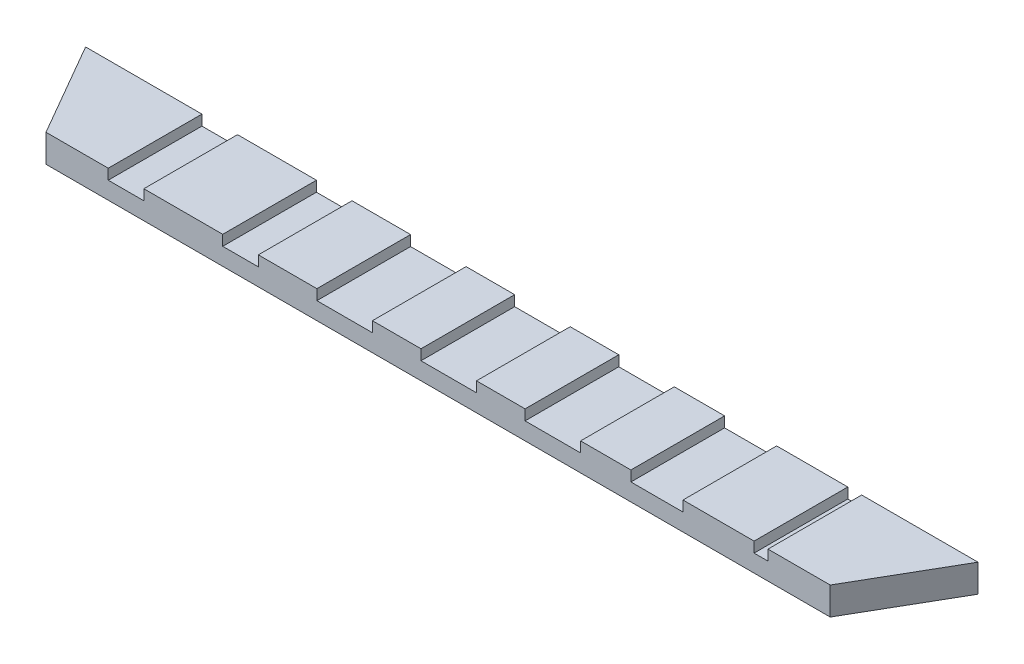
ISO-10303-21;
HEADER;
FILE_DESCRIPTION(('STEP AP214'),'2;1');
FILE_NAME('part.step','',(''),(''),'','','');
FILE_SCHEMA(('AUTOMOTIVE_DESIGN { 1 0 10303 214 1 1 1 1 }'));
ENDSEC;
DATA;
#1=APPLICATION_CONTEXT('core data for automotive mechanical design processes');
#2=APPLICATION_PROTOCOL_DEFINITION('international standard','automotive_design',2000,#1);
#3=PRODUCT_CONTEXT('',#1,'mechanical');
#4=PRODUCT('Part','Part','',(#3));
#5=PRODUCT_RELATED_PRODUCT_CATEGORY('part','',(#4));
#6=PRODUCT_DEFINITION_FORMATION('','',#4);
#7=PRODUCT_DEFINITION_CONTEXT('part definition',#1,'design');
#8=PRODUCT_DEFINITION('design','',#6,#7);
#9=PRODUCT_DEFINITION_SHAPE('','',#8);
#10=(LENGTH_UNIT() NAMED_UNIT(*) SI_UNIT(.MILLI.,.METRE.));
#11=(NAMED_UNIT(*) PLANE_ANGLE_UNIT() SI_UNIT($,.RADIAN.));
#12=(NAMED_UNIT(*) SI_UNIT($,.STERADIAN.) SOLID_ANGLE_UNIT());
#13=UNCERTAINTY_MEASURE_WITH_UNIT(LENGTH_MEASURE(1.E-05),#10,'distance_accuracy_value','');
#14=(GEOMETRIC_REPRESENTATION_CONTEXT(3) GLOBAL_UNCERTAINTY_ASSIGNED_CONTEXT((#13)) GLOBAL_UNIT_ASSIGNED_CONTEXT((#10,
#11,#12)) REPRESENTATION_CONTEXT('',''));
#15=CARTESIAN_POINT('',(0.,0.,0.));
#16=DIRECTION('',(0.,0.,1.));
#17=DIRECTION('',(1.,0.,0.));
#18=AXIS2_PLACEMENT_3D('',#15,#16,#17);
#19=CARTESIAN_POINT('',(0.,8.,0.));
#20=DIRECTION('',(0.,-1.,0.));
#21=DIRECTION('',(0.,0.,-1.));
#22=AXIS2_PLACEMENT_3D('',#19,#20,#21);
#23=PLANE('',#22);
#24=DIRECTION('',(-1.,0.,0.));
#25=VECTOR('',#24,1.);
#26=CARTESIAN_POINT('',(-128.58845726812,8.,-14.3710853800687));
#27=LINE('',#26,#25);
#28=CARTESIAN_POINT('',(-62.0645586842857,8.,-14.3710853800687));
#29=VERTEX_POINT('',#28);
#30=CARTESIAN_POINT('',(-84.806323947143,8.,-14.3710853800687));
#31=VERTEX_POINT('',#30);
#32=EDGE_CURVE('E524',#29,#31,#27,.T.);
#33=ORIENTED_EDGE('',*,*,#32,.T.);
#34=DIRECTION('',(0.,0.,-1.));
#35=VECTOR('',#34,1.);
#36=CARTESIAN_POINT('',(-84.806323947143,8.,-14.3710853800687));
#37=LINE('',#36,#35);
#38=CARTESIAN_POINT('',(-84.806323947143,8.,12.6289146199313));
#39=VERTEX_POINT('',#38);
#40=EDGE_CURVE('E247',#39,#31,#37,.T.);
#41=ORIENTED_EDGE('',*,*,#40,.F.);
#42=DIRECTION('',(1.,0.,0.));
#43=VECTOR('',#42,1.);
#44=CARTESIAN_POINT('',(-113.,8.,12.6289146199313));
#45=LINE('',#44,#43);
#46=CARTESIAN_POINT('',(-62.0645586842857,8.,12.6289146199313));
#47=VERTEX_POINT('',#46);
#48=EDGE_CURVE('E450',#39,#47,#45,.T.);
#49=ORIENTED_EDGE('',*,*,#48,.T.);
#50=DIRECTION('',(0.,0.,1.));
#51=VECTOR('',#50,1.);
#52=CARTESIAN_POINT('',(-62.0645586842857,8.,-14.3710853800687));
#53=LINE('',#52,#51);
#54=EDGE_CURVE('E284',#29,#47,#53,.T.);
#55=ORIENTED_EDGE('',*,*,#54,.F.);
#56=EDGE_LOOP('',(#33,#41,#49,#55));
#57=FACE_BOUND('',#56,.T.);
#58=ADVANCED_FACE('F33',(#57),#23,.F.);
#59=CARTESIAN_POINT('',(-34.9354413157144,8.,-14.3710853800687));
#60=VERTEX_POINT('',#59);
#61=CARTESIAN_POINT('',(-51.806323947143,8.,-14.3710853800687));
#62=VERTEX_POINT('',#61);
#63=EDGE_CURVE('E525',#60,#62,#27,.T.);
#64=ORIENTED_EDGE('',*,*,#63,.T.);
#65=DIRECTION('',(0.,0.,-1.));
#66=VECTOR('',#65,1.);
#67=CARTESIAN_POINT('',(-51.806323947143,8.,-14.3710853800687));
#68=LINE('',#67,#66);
#69=CARTESIAN_POINT('',(-51.806323947143,8.,12.6289146199313));
#70=VERTEX_POINT('',#69);
#71=EDGE_CURVE('E294',#70,#62,#68,.T.);
#72=ORIENTED_EDGE('',*,*,#71,.F.);
#73=CARTESIAN_POINT('',(-34.9354413157144,8.,12.6289146199313));
#74=VERTEX_POINT('',#73);
#75=EDGE_CURVE('E506',#70,#74,#45,.T.);
#76=ORIENTED_EDGE('',*,*,#75,.T.);
#77=DIRECTION('',(0.,0.,1.));
#78=VECTOR('',#77,1.);
#79=CARTESIAN_POINT('',(-34.9354413157144,8.,12.6289146199313));
#80=LINE('',#79,#78);
#81=EDGE_CURVE('E309',#60,#74,#80,.T.);
#82=ORIENTED_EDGE('',*,*,#81,.F.);
#83=EDGE_LOOP('',(#64,#72,#76,#82));
#84=FACE_BOUND('',#83,.T.);
#85=ADVANCED_FACE('F540',(#84),#23,.F.);
#86=CARTESIAN_POINT('',(-4.93544131571436,8.,-14.3710853800687));
#87=VERTEX_POINT('',#86);
#88=CARTESIAN_POINT('',(-18.9354413157143,8.,-14.3710853800687));
#89=VERTEX_POINT('',#88);
#90=EDGE_CURVE('E527',#87,#89,#27,.T.);
#91=ORIENTED_EDGE('',*,*,#90,.T.);
#92=DIRECTION('',(0.,0.,-1.));
#93=VECTOR('',#92,1.);
#94=CARTESIAN_POINT('',(-18.9354413157143,8.,12.6289146199313));
#95=LINE('',#94,#93);
#96=CARTESIAN_POINT('',(-18.9354413157143,8.,12.6289146199313));
#97=VERTEX_POINT('',#96);
#98=EDGE_CURVE('E319',#97,#89,#95,.T.);
#99=ORIENTED_EDGE('',*,*,#98,.F.);
#100=CARTESIAN_POINT('',(-4.93544131571435,8.,12.6289146199313));
#101=VERTEX_POINT('',#100);
#102=EDGE_CURVE('E500',#97,#101,#45,.T.);
#103=ORIENTED_EDGE('',*,*,#102,.T.);
#104=DIRECTION('',(0.,0.,1.));
#105=VECTOR('',#104,1.);
#106=CARTESIAN_POINT('',(-4.93544131571435,8.,12.6289146199313));
#107=LINE('',#106,#105);
#108=EDGE_CURVE('E335',#87,#101,#107,.T.);
#109=ORIENTED_EDGE('',*,*,#108,.F.);
#110=EDGE_LOOP('',(#91,#99,#103,#109));
#111=FACE_BOUND('',#110,.T.);
#112=ADVANCED_FACE('F546',(#111),#23,.F.);
#113=CARTESIAN_POINT('',(25.0645586842856,8.,-14.3710853800687));
#114=VERTEX_POINT('',#113);
#115=CARTESIAN_POINT('',(11.0645586842857,8.,-14.3710853800687));
#116=VERTEX_POINT('',#115);
#117=EDGE_CURVE('E574',#114,#116,#27,.T.);
#118=ORIENTED_EDGE('',*,*,#117,.T.);
#119=DIRECTION('',(0.,0.,-1.));
#120=VECTOR('',#119,1.);
#121=CARTESIAN_POINT('',(11.0645586842857,8.,12.6289146199313));
#122=LINE('',#121,#120);
#123=CARTESIAN_POINT('',(11.0645586842857,8.,12.6289146199313));
#124=VERTEX_POINT('',#123);
#125=EDGE_CURVE('E345',#124,#116,#122,.T.);
#126=ORIENTED_EDGE('',*,*,#125,.F.);
#127=CARTESIAN_POINT('',(25.0645586842857,8.,12.6289146199313));
#128=VERTEX_POINT('',#127);
#129=EDGE_CURVE('E494',#124,#128,#45,.T.);
#130=ORIENTED_EDGE('',*,*,#129,.T.);
#131=DIRECTION('',(0.,0.,1.));
#132=VECTOR('',#131,1.);
#133=CARTESIAN_POINT('',(25.0645586842857,8.,12.6289146199313));
#134=LINE('',#133,#132);
#135=EDGE_CURVE('E361',#114,#128,#134,.T.);
#136=ORIENTED_EDGE('',*,*,#135,.F.);
#137=EDGE_LOOP('',(#118,#126,#130,#136));
#138=FACE_BOUND('',#137,.T.);
#139=ADVANCED_FACE('F568',(#138),#23,.F.);
#140=CARTESIAN_POINT('',(55.5645586842856,8.,-14.3710853800687));
#141=VERTEX_POINT('',#140);
#142=CARTESIAN_POINT('',(41.0645586842857,8.,-14.3710853800687));
#143=VERTEX_POINT('',#142);
#144=EDGE_CURVE('E572',#141,#143,#27,.T.);
#145=ORIENTED_EDGE('',*,*,#144,.T.);
#146=DIRECTION('',(0.,0.,-1.));
#147=VECTOR('',#146,1.);
#148=CARTESIAN_POINT('',(41.0645586842857,8.,12.6289146199313));
#149=LINE('',#148,#147);
#150=CARTESIAN_POINT('',(41.0645586842857,8.,12.6289146199313));
#151=VERTEX_POINT('',#150);
#152=EDGE_CURVE('E371',#151,#143,#149,.T.);
#153=ORIENTED_EDGE('',*,*,#152,.F.);
#154=CARTESIAN_POINT('',(55.5645586842857,8.,12.6289146199313));
#155=VERTEX_POINT('',#154);
#156=EDGE_CURVE('E488',#151,#155,#45,.T.);
#157=ORIENTED_EDGE('',*,*,#156,.T.);
#158=DIRECTION('',(0.,0.,1.));
#159=VECTOR('',#158,1.);
#160=CARTESIAN_POINT('',(55.5645586842857,8.,12.6289146199313));
#161=LINE('',#160,#159);
#162=EDGE_CURVE('E387',#141,#155,#161,.T.);
#163=ORIENTED_EDGE('',*,*,#162,.F.);
#164=EDGE_LOOP('',(#145,#153,#157,#163));
#165=FACE_BOUND('',#164,.T.);
#166=ADVANCED_FACE('F564',(#165),#23,.F.);
#167=CARTESIAN_POINT('',(91.0645586842856,8.,-14.3710853800687));
#168=VERTEX_POINT('',#167);
#169=CARTESIAN_POINT('',(70.5645586842857,8.,-14.3710853800687));
#170=VERTEX_POINT('',#169);
#171=EDGE_CURVE('E443',#168,#170,#27,.T.);
#172=ORIENTED_EDGE('',*,*,#171,.T.);
#173=DIRECTION('',(0.,0.,-1.));
#174=VECTOR('',#173,1.);
#175=CARTESIAN_POINT('',(70.5645586842857,8.,12.6289146199313));
#176=LINE('',#175,#174);
#177=CARTESIAN_POINT('',(70.5645586842857,8.,12.6289146199313));
#178=VERTEX_POINT('',#177);
#179=EDGE_CURVE('E397',#178,#170,#176,.T.);
#180=ORIENTED_EDGE('',*,*,#179,.F.);
#181=CARTESIAN_POINT('',(91.0645586842856,8.,12.6289146199313));
#182=VERTEX_POINT('',#181);
#183=EDGE_CURVE('E486',#178,#182,#45,.T.);
#184=ORIENTED_EDGE('',*,*,#183,.T.);
#185=DIRECTION('',(0.,0.,1.));
#186=VECTOR('',#185,1.);
#187=CARTESIAN_POINT('',(91.0645586842856,8.,12.6289146199313));
#188=LINE('',#187,#186);
#189=EDGE_CURVE('E413',#168,#182,#188,.T.);
#190=ORIENTED_EDGE('',*,*,#189,.F.);
#191=EDGE_LOOP('',(#172,#180,#184,#190));
#192=FACE_BOUND('',#191,.T.);
#193=ADVANCED_FACE('F558',(#192),#23,.F.);
#194=CARTESIAN_POINT('',(128.58845726812,8.,-14.3710853800687));
#195=VERTEX_POINT('',#194);
#196=CARTESIAN_POINT('',(95.0645586842856,8.,-14.3710853800687));
#197=VERTEX_POINT('',#196);
#198=EDGE_CURVE('E439',#195,#197,#27,.T.);
#199=ORIENTED_EDGE('',*,*,#198,.T.);
#200=DIRECTION('',(0.,0.,-1.));
#201=VECTOR('',#200,1.);
#202=CARTESIAN_POINT('',(95.0645586842856,8.,12.6289146199313));
#203=LINE('',#202,#201);
#204=CARTESIAN_POINT('',(95.0645586842856,8.,12.6289146199313));
#205=VERTEX_POINT('',#204);
#206=EDGE_CURVE('E423',#205,#197,#203,.T.);
#207=ORIENTED_EDGE('',*,*,#206,.F.);
#208=CARTESIAN_POINT('',(113.,8.,12.6289146199313));
#209=VERTEX_POINT('',#208);
#210=EDGE_CURVE('E445',#205,#209,#45,.T.);
#211=ORIENTED_EDGE('',*,*,#210,.T.);
#212=DIRECTION('',(0.499999999999998,0.,-0.86602540378444));
#213=VECTOR('',#212,1.);
#214=CARTESIAN_POINT('',(113.,8.,12.6289146199313));
#215=LINE('',#214,#213);
#216=EDGE_CURVE('E434',#209,#195,#215,.T.);
#217=ORIENTED_EDGE('',*,*,#216,.T.);
#218=EDGE_LOOP('',(#199,#207,#211,#217));
#219=FACE_BOUND('',#218,.T.);
#220=ADVANCED_FACE('F483',(#219),#23,.F.);
#221=CARTESIAN_POINT('',(113.,8.,12.6289146199313));
#222=DIRECTION('',(-0.86602540378444,0.,-0.499999999999998));
#223=DIRECTION('',(-0.499999999999998,0.,0.86602540378444));
#224=AXIS2_PLACEMENT_3D('',#221,#222,#223);
#225=PLANE('',#224);
#226=DIRECTION('',(0.499999999999998,0.,-0.86602540378444));
#227=VECTOR('',#226,1.);
#228=CARTESIAN_POINT('',(113.,0.,12.6289146199313));
#229=LINE('',#228,#227);
#230=CARTESIAN_POINT('',(113.,0.,12.6289146199313));
#231=VERTEX_POINT('',#230);
#232=CARTESIAN_POINT('',(128.58845726812,0.,-14.3710853800687));
#233=VERTEX_POINT('',#232);
#234=EDGE_CURVE('E275',#231,#233,#229,.T.);
#235=ORIENTED_EDGE('',*,*,#234,.T.);
#236=DIRECTION('',(0.,-1.,0.));
#237=VECTOR('',#236,1.);
#238=CARTESIAN_POINT('',(128.58845726812,8.,-14.3710853800687));
#239=LINE('',#238,#237);
#240=EDGE_CURVE('E11',#195,#233,#239,.T.);
#241=ORIENTED_EDGE('',*,*,#240,.F.);
#242=ORIENTED_EDGE('',*,*,#216,.F.);
#243=DIRECTION('',(0.,-1.,0.));
#244=VECTOR('',#243,1.);
#245=CARTESIAN_POINT('',(113.,8.,12.6289146199313));
#246=LINE('',#245,#244);
#247=EDGE_CURVE('E449',#209,#231,#246,.T.);
#248=ORIENTED_EDGE('',*,*,#247,.T.);
#249=EDGE_LOOP('',(#235,#241,#242,#248));
#250=FACE_BOUND('',#249,.T.);
#251=ADVANCED_FACE('F35',(#250),#225,.F.);
#252=CARTESIAN_POINT('',(-128.58845726812,8.,-14.3710853800687));
#253=DIRECTION('',(0.,0.,1.));
#254=DIRECTION('',(1.,0.,0.));
#255=AXIS2_PLACEMENT_3D('',#252,#253,#254);
#256=PLANE('',#255);
#257=DIRECTION('',(-1.,0.,0.));
#258=VECTOR('',#257,1.);
#259=CARTESIAN_POINT('',(-95.0645586842856,5.,-14.3710853800687));
#260=LINE('',#259,#258);
#261=CARTESIAN_POINT('',(-84.806323947143,5.,-14.3710853800687));
#262=VERTEX_POINT('',#261);
#263=CARTESIAN_POINT('',(-95.0645586842856,5.,-14.3710853800687));
#264=VERTEX_POINT('',#263);
#265=EDGE_CURVE('E258',#262,#264,#260,.T.);
#266=ORIENTED_EDGE('',*,*,#265,.F.);
#267=DIRECTION('',(0.,1.,0.));
#268=VECTOR('',#267,1.);
#269=CARTESIAN_POINT('',(-84.806323947143,5.,-14.3710853800687));
#270=LINE('',#269,#268);
#271=EDGE_CURVE('E241',#262,#31,#270,.T.);
#272=ORIENTED_EDGE('',*,*,#271,.T.);
#273=ORIENTED_EDGE('',*,*,#32,.F.);
#274=DIRECTION('',(0.,1.,0.));
#275=VECTOR('',#274,1.);
#276=CARTESIAN_POINT('',(-62.0645586842857,5.,-14.3710853800687));
#277=LINE('',#276,#275);
#278=CARTESIAN_POINT('',(-62.0645586842857,5.,-14.3710853800687));
#279=VERTEX_POINT('',#278);
#280=EDGE_CURVE('E56',#279,#29,#277,.T.);
#281=ORIENTED_EDGE('',*,*,#280,.F.);
#282=DIRECTION('',(-1.,0.,0.));
#283=VECTOR('',#282,1.);
#284=CARTESIAN_POINT('',(-62.0645586842857,5.,-14.3710853800687));
#285=LINE('',#284,#283);
#286=CARTESIAN_POINT('',(-51.806323947143,5.,-14.3710853800687));
#287=VERTEX_POINT('',#286);
#288=EDGE_CURVE('E283',#287,#279,#285,.T.);
#289=ORIENTED_EDGE('',*,*,#288,.F.);
#290=DIRECTION('',(0.,1.,0.));
#291=VECTOR('',#290,1.);
#292=CARTESIAN_POINT('',(-51.806323947143,5.,-14.3710853800687));
#293=LINE('',#292,#291);
#294=EDGE_CURVE('E293',#287,#62,#293,.T.);
#295=ORIENTED_EDGE('',*,*,#294,.T.);
#296=ORIENTED_EDGE('',*,*,#63,.F.);
#297=DIRECTION('',(0.,1.,0.));
#298=VECTOR('',#297,1.);
#299=CARTESIAN_POINT('',(-34.9354413157144,5.,-14.3710853800687));
#300=LINE('',#299,#298);
#301=CARTESIAN_POINT('',(-34.9354413157144,5.,-14.3710853800687));
#302=VERTEX_POINT('',#301);
#303=EDGE_CURVE('E327',#302,#60,#300,.T.);
#304=ORIENTED_EDGE('',*,*,#303,.F.);
#305=DIRECTION('',(-1.,0.,0.));
#306=VECTOR('',#305,1.);
#307=CARTESIAN_POINT('',(-34.9354413157144,5.,-14.3710853800687));
#308=LINE('',#307,#306);
#309=CARTESIAN_POINT('',(-18.9354413157143,5.,-14.3710853800687));
#310=VERTEX_POINT('',#309);
#311=EDGE_CURVE('E308',#310,#302,#308,.T.);
#312=ORIENTED_EDGE('',*,*,#311,.F.);
#313=DIRECTION('',(0.,1.,0.));
#314=VECTOR('',#313,1.);
#315=CARTESIAN_POINT('',(-18.9354413157143,5.,-14.3710853800687));
#316=LINE('',#315,#314);
#317=EDGE_CURVE('E318',#310,#89,#316,.T.);
#318=ORIENTED_EDGE('',*,*,#317,.T.);
#319=ORIENTED_EDGE('',*,*,#90,.F.);
#320=DIRECTION('',(0.,1.,0.));
#321=VECTOR('',#320,1.);
#322=CARTESIAN_POINT('',(-4.93544131571435,5.,-14.3710853800687));
#323=LINE('',#322,#321);
#324=CARTESIAN_POINT('',(-4.93544131571435,5.,-14.3710853800687));
#325=VERTEX_POINT('',#324);
#326=EDGE_CURVE('E353',#325,#87,#323,.T.);
#327=ORIENTED_EDGE('',*,*,#326,.F.);
#328=DIRECTION('',(-1.,0.,0.));
#329=VECTOR('',#328,1.);
#330=CARTESIAN_POINT('',(-4.93544131571435,5.,-14.3710853800687));
#331=LINE('',#330,#329);
#332=CARTESIAN_POINT('',(11.0645586842857,5.,-14.3710853800687));
#333=VERTEX_POINT('',#332);
#334=EDGE_CURVE('E334',#333,#325,#331,.T.);
#335=ORIENTED_EDGE('',*,*,#334,.F.);
#336=DIRECTION('',(0.,1.,0.));
#337=VECTOR('',#336,1.);
#338=CARTESIAN_POINT('',(11.0645586842857,5.,-14.3710853800687));
#339=LINE('',#338,#337);
#340=EDGE_CURVE('E344',#333,#116,#339,.T.);
#341=ORIENTED_EDGE('',*,*,#340,.T.);
#342=ORIENTED_EDGE('',*,*,#117,.F.);
#343=DIRECTION('',(0.,1.,0.));
#344=VECTOR('',#343,1.);
#345=CARTESIAN_POINT('',(25.0645586842857,5.,-14.3710853800687));
#346=LINE('',#345,#344);
#347=CARTESIAN_POINT('',(25.0645586842857,5.,-14.3710853800687));
#348=VERTEX_POINT('',#347);
#349=EDGE_CURVE('E379',#348,#114,#346,.T.);
#350=ORIENTED_EDGE('',*,*,#349,.F.);
#351=DIRECTION('',(-1.,0.,0.));
#352=VECTOR('',#351,1.);
#353=CARTESIAN_POINT('',(25.0645586842857,5.,-14.3710853800687));
#354=LINE('',#353,#352);
#355=CARTESIAN_POINT('',(41.0645586842857,5.,-14.3710853800687));
#356=VERTEX_POINT('',#355);
#357=EDGE_CURVE('E360',#356,#348,#354,.T.);
#358=ORIENTED_EDGE('',*,*,#357,.F.);
#359=DIRECTION('',(0.,1.,0.));
#360=VECTOR('',#359,1.);
#361=CARTESIAN_POINT('',(41.0645586842857,5.,-14.3710853800687));
#362=LINE('',#361,#360);
#363=EDGE_CURVE('E370',#356,#143,#362,.T.);
#364=ORIENTED_EDGE('',*,*,#363,.T.);
#365=ORIENTED_EDGE('',*,*,#144,.F.);
#366=DIRECTION('',(0.,1.,0.));
#367=VECTOR('',#366,1.);
#368=CARTESIAN_POINT('',(55.5645586842857,5.,-14.3710853800687));
#369=LINE('',#368,#367);
#370=CARTESIAN_POINT('',(55.5645586842857,5.,-14.3710853800687));
#371=VERTEX_POINT('',#370);
#372=EDGE_CURVE('E405',#371,#141,#369,.T.);
#373=ORIENTED_EDGE('',*,*,#372,.F.);
#374=DIRECTION('',(-1.,0.,0.));
#375=VECTOR('',#374,1.);
#376=CARTESIAN_POINT('',(55.5645586842857,5.,-14.3710853800687));
#377=LINE('',#376,#375);
#378=CARTESIAN_POINT('',(70.5645586842857,5.,-14.3710853800687));
#379=VERTEX_POINT('',#378);
#380=EDGE_CURVE('E386',#379,#371,#377,.T.);
#381=ORIENTED_EDGE('',*,*,#380,.F.);
#382=DIRECTION('',(0.,1.,0.));
#383=VECTOR('',#382,1.);
#384=CARTESIAN_POINT('',(70.5645586842857,5.,-14.3710853800687));
#385=LINE('',#384,#383);
#386=EDGE_CURVE('E396',#379,#170,#385,.T.);
#387=ORIENTED_EDGE('',*,*,#386,.T.);
#388=ORIENTED_EDGE('',*,*,#171,.F.);
#389=DIRECTION('',(0.,1.,0.));
#390=VECTOR('',#389,1.);
#391=CARTESIAN_POINT('',(91.0645586842856,5.,-14.3710853800687));
#392=LINE('',#391,#390);
#393=CARTESIAN_POINT('',(91.0645586842856,5.,-14.3710853800687));
#394=VERTEX_POINT('',#393);
#395=EDGE_CURVE('E430',#394,#168,#392,.T.);
#396=ORIENTED_EDGE('',*,*,#395,.F.);
#397=DIRECTION('',(-1.,0.,0.));
#398=VECTOR('',#397,1.);
#399=CARTESIAN_POINT('',(91.0645586842856,5.,-14.3710853800687));
#400=LINE('',#399,#398);
#401=CARTESIAN_POINT('',(95.0645586842856,5.,-14.3710853800687));
#402=VERTEX_POINT('',#401);
#403=EDGE_CURVE('E412',#402,#394,#400,.T.);
#404=ORIENTED_EDGE('',*,*,#403,.F.);
#405=DIRECTION('',(0.,1.,0.));
#406=VECTOR('',#405,1.);
#407=CARTESIAN_POINT('',(95.0645586842856,5.,-14.3710853800687));
#408=LINE('',#407,#406);
#409=EDGE_CURVE('E422',#402,#197,#408,.T.);
#410=ORIENTED_EDGE('',*,*,#409,.T.);
#411=ORIENTED_EDGE('',*,*,#198,.F.);
#412=ORIENTED_EDGE('',*,*,#240,.T.);
#413=DIRECTION('',(-1.,0.,0.));
#414=VECTOR('',#413,1.);
#415=CARTESIAN_POINT('',(-128.58845726812,0.,-14.3710853800687));
#416=LINE('',#415,#414);
#417=CARTESIAN_POINT('',(-128.58845726812,0.,-14.3710853800687));
#418=VERTEX_POINT('',#417);
#419=EDGE_CURVE('E453',#233,#418,#416,.T.);
#420=ORIENTED_EDGE('',*,*,#419,.T.);
#421=DIRECTION('',(0.,-1.,0.));
#422=VECTOR('',#421,1.);
#423=CARTESIAN_POINT('',(-128.58845726812,8.,-14.3710853800687));
#424=LINE('',#423,#422);
#425=CARTESIAN_POINT('',(-128.58845726812,8.,-14.3710853800687));
#426=VERTEX_POINT('',#425);
#427=EDGE_CURVE('E41',#426,#418,#424,.T.);
#428=ORIENTED_EDGE('',*,*,#427,.F.);
#429=CARTESIAN_POINT('',(-95.0645586842856,8.,-14.3710853800687));
#430=VERTEX_POINT('',#429);
#431=EDGE_CURVE('E437',#430,#426,#27,.T.);
#432=ORIENTED_EDGE('',*,*,#431,.F.);
#433=DIRECTION('',(0.,1.,0.));
#434=VECTOR('',#433,1.);
#435=CARTESIAN_POINT('',(-95.0645586842856,5.,-14.3710853800687));
#436=LINE('',#435,#434);
#437=EDGE_CURVE('E48',#264,#430,#436,.T.);
#438=ORIENTED_EDGE('',*,*,#437,.F.);
#439=EDGE_LOOP('',(#266,#272,#273,#281,#289,#295,#296,#304,#312,#318,#319,#327,#335,#341,#342,
#350,#358,#364,#365,#373,#381,#387,#388,#396,#404,#410,#411,#412,#420,#428,#432,#438));
#440=FACE_BOUND('',#439,.T.);
#441=ADVANCED_FACE('F263',(#440),#256,.F.);
#442=CARTESIAN_POINT('',(-113.,8.,12.6289146199313));
#443=DIRECTION('',(0.86602540378444,0.,-0.499999999999997));
#444=DIRECTION('',(-0.499999999999997,0.,-0.86602540378444));
#445=AXIS2_PLACEMENT_3D('',#442,#443,#444);
#446=PLANE('',#445);
#447=DIRECTION('',(0.499999999999997,0.,0.86602540378444));
#448=VECTOR('',#447,1.);
#449=CARTESIAN_POINT('',(-113.,0.,12.6289146199313));
#450=LINE('',#449,#448);
#451=CARTESIAN_POINT('',(-113.,0.,12.6289146199313));
#452=VERTEX_POINT('',#451);
#453=EDGE_CURVE('E455',#418,#452,#450,.T.);
#454=ORIENTED_EDGE('',*,*,#453,.T.);
#455=DIRECTION('',(0.,-1.,0.));
#456=VECTOR('',#455,1.);
#457=CARTESIAN_POINT('',(-113.,8.,12.6289146199313));
#458=LINE('',#457,#456);
#459=CARTESIAN_POINT('',(-113.,8.,12.6289146199313));
#460=VERTEX_POINT('',#459);
#461=EDGE_CURVE('E460',#460,#452,#458,.T.);
#462=ORIENTED_EDGE('',*,*,#461,.F.);
#463=DIRECTION('',(0.499999999999997,0.,0.86602540378444));
#464=VECTOR('',#463,1.);
#465=CARTESIAN_POINT('',(-113.,8.,12.6289146199313));
#466=LINE('',#465,#464);
#467=EDGE_CURVE('E442',#426,#460,#466,.T.);
#468=ORIENTED_EDGE('',*,*,#467,.F.);
#469=ORIENTED_EDGE('',*,*,#427,.T.);
#470=EDGE_LOOP('',(#454,#462,#468,#469));
#471=FACE_BOUND('',#470,.T.);
#472=ADVANCED_FACE('F467',(#471),#446,.F.);
#473=CARTESIAN_POINT('',(-113.,8.,12.6289146199313));
#474=DIRECTION('',(0.,0.,-1.));
#475=DIRECTION('',(-1.,0.,0.));
#476=AXIS2_PLACEMENT_3D('',#473,#474,#475);
#477=PLANE('',#476);
#478=ORIENTED_EDGE('',*,*,#48,.F.);
#479=DIRECTION('',(0.,1.,0.));
#480=VECTOR('',#479,1.);
#481=CARTESIAN_POINT('',(-84.806323947143,5.,12.6289146199313));
#482=LINE('',#481,#480);
#483=CARTESIAN_POINT('',(-84.806323947143,5.,12.6289146199313));
#484=VERTEX_POINT('',#483);
#485=EDGE_CURVE('E273',#484,#39,#482,.T.);
#486=ORIENTED_EDGE('',*,*,#485,.F.);
#487=DIRECTION('',(1.,0.,0.));
#488=VECTOR('',#487,1.);
#489=CARTESIAN_POINT('',(-95.0645586842856,5.,12.6289146199313));
#490=LINE('',#489,#488);
#491=CARTESIAN_POINT('',(-95.0645586842856,5.,12.6289146199313));
#492=VERTEX_POINT('',#491);
#493=EDGE_CURVE('E252',#492,#484,#490,.T.);
#494=ORIENTED_EDGE('',*,*,#493,.F.);
#495=DIRECTION('',(0.,1.,0.));
#496=VECTOR('',#495,1.);
#497=CARTESIAN_POINT('',(-95.0645586842856,5.,12.6289146199313));
#498=LINE('',#497,#496);
#499=CARTESIAN_POINT('',(-95.0645586842856,8.,12.6289146199313));
#500=VERTEX_POINT('',#499);
#501=EDGE_CURVE('E276',#492,#500,#498,.T.);
#502=ORIENTED_EDGE('',*,*,#501,.T.);
#503=EDGE_CURVE('E446',#460,#500,#45,.T.);
#504=ORIENTED_EDGE('',*,*,#503,.F.);
#505=ORIENTED_EDGE('',*,*,#461,.T.);
#506=DIRECTION('',(1.,0.,0.));
#507=VECTOR('',#506,1.);
#508=CARTESIAN_POINT('',(-113.,0.,12.6289146199313));
#509=LINE('',#508,#507);
#510=EDGE_CURVE('E438',#452,#231,#509,.T.);
#511=ORIENTED_EDGE('',*,*,#510,.T.);
#512=ORIENTED_EDGE('',*,*,#247,.F.);
#513=ORIENTED_EDGE('',*,*,#210,.F.);
#514=DIRECTION('',(0.,1.,0.));
#515=VECTOR('',#514,1.);
#516=CARTESIAN_POINT('',(95.0645586842856,5.,12.6289146199313));
#517=LINE('',#516,#515);
#518=CARTESIAN_POINT('',(95.0645586842856,5.,12.6289146199313));
#519=VERTEX_POINT('',#518);
#520=EDGE_CURVE('E399',#519,#205,#517,.T.);
#521=ORIENTED_EDGE('',*,*,#520,.F.);
#522=DIRECTION('',(1.,0.,0.));
#523=VECTOR('',#522,1.);
#524=CARTESIAN_POINT('',(91.0645586842856,5.,12.6289146199313));
#525=LINE('',#524,#523);
#526=CARTESIAN_POINT('',(91.0645586842856,5.,12.6289146199313));
#527=VERTEX_POINT('',#526);
#528=EDGE_CURVE('E419',#527,#519,#525,.T.);
#529=ORIENTED_EDGE('',*,*,#528,.F.);
#530=DIRECTION('',(0.,1.,0.));
#531=VECTOR('',#530,1.);
#532=CARTESIAN_POINT('',(91.0645586842856,5.,12.6289146199313));
#533=LINE('',#532,#531);
#534=EDGE_CURVE('E427',#527,#182,#533,.T.);
#535=ORIENTED_EDGE('',*,*,#534,.T.);
#536=ORIENTED_EDGE('',*,*,#183,.F.);
#537=DIRECTION('',(0.,1.,0.));
#538=VECTOR('',#537,1.);
#539=CARTESIAN_POINT('',(70.5645586842857,5.,12.6289146199313));
#540=LINE('',#539,#538);
#541=CARTESIAN_POINT('',(70.5645586842857,5.,12.6289146199313));
#542=VERTEX_POINT('',#541);
#543=EDGE_CURVE('E373',#542,#178,#540,.T.);
#544=ORIENTED_EDGE('',*,*,#543,.F.);
#545=DIRECTION('',(1.,0.,0.));
#546=VECTOR('',#545,1.);
#547=CARTESIAN_POINT('',(55.5645586842857,5.,12.6289146199313));
#548=LINE('',#547,#546);
#549=CARTESIAN_POINT('',(55.5645586842857,5.,12.6289146199313));
#550=VERTEX_POINT('',#549);
#551=EDGE_CURVE('E393',#550,#542,#548,.T.);
#552=ORIENTED_EDGE('',*,*,#551,.F.);
#553=DIRECTION('',(0.,1.,0.));
#554=VECTOR('',#553,1.);
#555=CARTESIAN_POINT('',(55.5645586842857,5.,12.6289146199313));
#556=LINE('',#555,#554);
#557=EDGE_CURVE('E402',#550,#155,#556,.T.);
#558=ORIENTED_EDGE('',*,*,#557,.T.);
#559=ORIENTED_EDGE('',*,*,#156,.F.);
#560=DIRECTION('',(0.,1.,0.));
#561=VECTOR('',#560,1.);
#562=CARTESIAN_POINT('',(41.0645586842857,5.,12.6289146199313));
#563=LINE('',#562,#561);
#564=CARTESIAN_POINT('',(41.0645586842857,5.,12.6289146199313));
#565=VERTEX_POINT('',#564);
#566=EDGE_CURVE('E347',#565,#151,#563,.T.);
#567=ORIENTED_EDGE('',*,*,#566,.F.);
#568=DIRECTION('',(1.,0.,0.));
#569=VECTOR('',#568,1.);
#570=CARTESIAN_POINT('',(25.0645586842857,5.,12.6289146199313));
#571=LINE('',#570,#569);
#572=CARTESIAN_POINT('',(25.0645586842857,5.,12.6289146199313));
#573=VERTEX_POINT('',#572);
#574=EDGE_CURVE('E367',#573,#565,#571,.T.);
#575=ORIENTED_EDGE('',*,*,#574,.F.);
#576=DIRECTION('',(0.,1.,0.));
#577=VECTOR('',#576,1.);
#578=CARTESIAN_POINT('',(25.0645586842857,5.,12.6289146199313));
#579=LINE('',#578,#577);
#580=EDGE_CURVE('E376',#573,#128,#579,.T.);
#581=ORIENTED_EDGE('',*,*,#580,.T.);
#582=ORIENTED_EDGE('',*,*,#129,.F.);
#583=DIRECTION('',(0.,1.,0.));
#584=VECTOR('',#583,1.);
#585=CARTESIAN_POINT('',(11.0645586842857,5.,12.6289146199313));
#586=LINE('',#585,#584);
#587=CARTESIAN_POINT('',(11.0645586842857,5.,12.6289146199313));
#588=VERTEX_POINT('',#587);
#589=EDGE_CURVE('E321',#588,#124,#586,.T.);
#590=ORIENTED_EDGE('',*,*,#589,.F.);
#591=DIRECTION('',(1.,0.,0.));
#592=VECTOR('',#591,1.);
#593=CARTESIAN_POINT('',(-4.93544131571435,5.,12.6289146199313));
#594=LINE('',#593,#592);
#595=CARTESIAN_POINT('',(-4.93544131571435,5.,12.6289146199313));
#596=VERTEX_POINT('',#595);
#597=EDGE_CURVE('E341',#596,#588,#594,.T.);
#598=ORIENTED_EDGE('',*,*,#597,.F.);
#599=DIRECTION('',(0.,1.,0.));
#600=VECTOR('',#599,1.);
#601=CARTESIAN_POINT('',(-4.93544131571435,5.,12.6289146199313));
#602=LINE('',#601,#600);
#603=EDGE_CURVE('E350',#596,#101,#602,.T.);
#604=ORIENTED_EDGE('',*,*,#603,.T.);
#605=ORIENTED_EDGE('',*,*,#102,.F.);
#606=DIRECTION('',(0.,1.,0.));
#607=VECTOR('',#606,1.);
#608=CARTESIAN_POINT('',(-18.9354413157143,5.,12.6289146199313));
#609=LINE('',#608,#607);
#610=CARTESIAN_POINT('',(-18.9354413157143,5.,12.6289146199313));
#611=VERTEX_POINT('',#610);
#612=EDGE_CURVE('E296',#611,#97,#609,.T.);
#613=ORIENTED_EDGE('',*,*,#612,.F.);
#614=DIRECTION('',(1.,0.,0.));
#615=VECTOR('',#614,1.);
#616=CARTESIAN_POINT('',(-34.9354413157144,5.,12.6289146199313));
#617=LINE('',#616,#615);
#618=CARTESIAN_POINT('',(-34.9354413157144,5.,12.6289146199313));
#619=VERTEX_POINT('',#618);
#620=EDGE_CURVE('E315',#619,#611,#617,.T.);
#621=ORIENTED_EDGE('',*,*,#620,.F.);
#622=DIRECTION('',(0.,1.,0.));
#623=VECTOR('',#622,1.);
#624=CARTESIAN_POINT('',(-34.9354413157144,5.,12.6289146199313));
#625=LINE('',#624,#623);
#626=EDGE_CURVE('E324',#619,#74,#625,.T.);
#627=ORIENTED_EDGE('',*,*,#626,.T.);
#628=ORIENTED_EDGE('',*,*,#75,.F.);
#629=DIRECTION('',(0.,1.,0.));
#630=VECTOR('',#629,1.);
#631=CARTESIAN_POINT('',(-51.806323947143,5.,12.6289146199313));
#632=LINE('',#631,#630);
#633=CARTESIAN_POINT('',(-51.806323947143,5.,12.6289146199313));
#634=VERTEX_POINT('',#633);
#635=EDGE_CURVE('E271',#634,#70,#632,.T.);
#636=ORIENTED_EDGE('',*,*,#635,.F.);
#637=DIRECTION('',(1.,0.,0.));
#638=VECTOR('',#637,1.);
#639=CARTESIAN_POINT('',(-62.0645586842857,5.,12.6289146199313));
#640=LINE('',#639,#638);
#641=CARTESIAN_POINT('',(-62.0645586842857,5.,12.6289146199313));
#642=VERTEX_POINT('',#641);
#643=EDGE_CURVE('E290',#642,#634,#640,.T.);
#644=ORIENTED_EDGE('',*,*,#643,.F.);
#645=DIRECTION('',(0.,1.,0.));
#646=VECTOR('',#645,1.);
#647=CARTESIAN_POINT('',(-62.0645586842857,5.,12.6289146199313));
#648=LINE('',#647,#646);
#649=EDGE_CURVE('E299',#642,#47,#648,.T.);
#650=ORIENTED_EDGE('',*,*,#649,.T.);
#651=EDGE_LOOP('',(#478,#486,#494,#502,#504,#505,#511,#512,#513,#521,#529,#535,#536,#544,#552,
#558,#559,#567,#575,#581,#582,#590,#598,#604,#605,#613,#621,#627,#628,#636,#644,#650));
#652=FACE_BOUND('',#651,.T.);
#653=ADVANCED_FACE('F476',(#652),#477,.F.);
#654=ORIENTED_EDGE('',*,*,#503,.T.);
#655=DIRECTION('',(0.,0.,1.));
#656=VECTOR('',#655,1.);
#657=CARTESIAN_POINT('',(-95.0645586842856,8.,-14.3710853800687));
#658=LINE('',#657,#656);
#659=EDGE_CURVE('E261',#430,#500,#658,.T.);
#660=ORIENTED_EDGE('',*,*,#659,.F.);
#661=ORIENTED_EDGE('',*,*,#431,.T.);
#662=ORIENTED_EDGE('',*,*,#467,.T.);
#663=EDGE_LOOP('',(#654,#660,#661,#662));
#664=FACE_BOUND('',#663,.T.);
#665=ADVANCED_FACE('F529',(#664),#23,.F.);
#666=CARTESIAN_POINT('',(0.,0.,0.));
#667=DIRECTION('',(0.,-1.,0.));
#668=DIRECTION('',(0.,0.,-1.));
#669=AXIS2_PLACEMENT_3D('',#666,#667,#668);
#670=PLANE('',#669);
#671=ORIENTED_EDGE('',*,*,#234,.F.);
#672=ORIENTED_EDGE('',*,*,#510,.F.);
#673=ORIENTED_EDGE('',*,*,#453,.F.);
#674=ORIENTED_EDGE('',*,*,#419,.F.);
#675=EDGE_LOOP('',(#671,#672,#673,#674));
#676=FACE_BOUND('',#675,.T.);
#677=ADVANCED_FACE('F472',(#676),#670,.T.);
#678=CARTESIAN_POINT('',(95.0645586842856,5.,12.6289146199313));
#679=DIRECTION('',(1.,0.,0.));
#680=DIRECTION('',(0.,0.,-1.));
#681=AXIS2_PLACEMENT_3D('',#678,#679,#680);
#682=PLANE('',#681);
#683=ORIENTED_EDGE('',*,*,#206,.T.);
#684=ORIENTED_EDGE('',*,*,#409,.F.);
#685=DIRECTION('',(0.,0.,-1.));
#686=VECTOR('',#685,1.);
#687=CARTESIAN_POINT('',(95.0645586842856,5.,12.6289146199313));
#688=LINE('',#687,#686);
#689=EDGE_CURVE('E409',#519,#402,#688,.T.);
#690=ORIENTED_EDGE('',*,*,#689,.F.);
#691=ORIENTED_EDGE('',*,*,#520,.T.);
#692=EDGE_LOOP('',(#683,#684,#690,#691));
#693=FACE_BOUND('',#692,.T.);
#694=ADVANCED_FACE('F555',(#693),#682,.F.);
#695=CARTESIAN_POINT('',(91.0645586842856,5.,12.6289146199313));
#696=DIRECTION('',(-1.,0.,0.));
#697=DIRECTION('',(0.,0.,1.));
#698=AXIS2_PLACEMENT_3D('',#695,#696,#697);
#699=PLANE('',#698);
#700=ORIENTED_EDGE('',*,*,#189,.T.);
#701=ORIENTED_EDGE('',*,*,#534,.F.);
#702=DIRECTION('',(0.,0.,1.));
#703=VECTOR('',#702,1.);
#704=CARTESIAN_POINT('',(91.0645586842856,5.,12.6289146199313));
#705=LINE('',#704,#703);
#706=EDGE_CURVE('E416',#394,#527,#705,.T.);
#707=ORIENTED_EDGE('',*,*,#706,.F.);
#708=ORIENTED_EDGE('',*,*,#395,.T.);
#709=EDGE_LOOP('',(#700,#701,#707,#708));
#710=FACE_BOUND('',#709,.T.);
#711=ADVANCED_FACE('F620',(#710),#699,.F.);
#712=CARTESIAN_POINT('',(0.,5.,0.));
#713=DIRECTION('',(0.,-1.,0.));
#714=DIRECTION('',(0.,0.,-1.));
#715=AXIS2_PLACEMENT_3D('',#712,#713,#714);
#716=PLANE('',#715);
#717=ORIENTED_EDGE('',*,*,#689,.T.);
#718=ORIENTED_EDGE('',*,*,#403,.T.);
#719=ORIENTED_EDGE('',*,*,#706,.T.);
#720=ORIENTED_EDGE('',*,*,#528,.T.);
#721=EDGE_LOOP('',(#717,#718,#719,#720));
#722=FACE_BOUND('',#721,.T.);
#723=ADVANCED_FACE('F622',(#722),#716,.F.);
#724=CARTESIAN_POINT('',(70.5645586842857,5.,12.6289146199313));
#725=DIRECTION('',(1.,0.,0.));
#726=DIRECTION('',(0.,0.,-1.));
#727=AXIS2_PLACEMENT_3D('',#724,#725,#726);
#728=PLANE('',#727);
#729=ORIENTED_EDGE('',*,*,#179,.T.);
#730=ORIENTED_EDGE('',*,*,#386,.F.);
#731=DIRECTION('',(0.,0.,-1.));
#732=VECTOR('',#731,1.);
#733=CARTESIAN_POINT('',(70.5645586842857,5.,12.6289146199313));
#734=LINE('',#733,#732);
#735=EDGE_CURVE('E383',#542,#379,#734,.T.);
#736=ORIENTED_EDGE('',*,*,#735,.F.);
#737=ORIENTED_EDGE('',*,*,#543,.T.);
#738=EDGE_LOOP('',(#729,#730,#736,#737));
#739=FACE_BOUND('',#738,.T.);
#740=ADVANCED_FACE('F617',(#739),#728,.F.);
#741=CARTESIAN_POINT('',(55.5645586842857,5.,12.6289146199313));
#742=DIRECTION('',(-1.,0.,0.));
#743=DIRECTION('',(0.,0.,1.));
#744=AXIS2_PLACEMENT_3D('',#741,#742,#743);
#745=PLANE('',#744);
#746=ORIENTED_EDGE('',*,*,#162,.T.);
#747=ORIENTED_EDGE('',*,*,#557,.F.);
#748=DIRECTION('',(0.,0.,1.));
#749=VECTOR('',#748,1.);
#750=CARTESIAN_POINT('',(55.5645586842857,5.,12.6289146199313));
#751=LINE('',#750,#749);
#752=EDGE_CURVE('E390',#371,#550,#751,.T.);
#753=ORIENTED_EDGE('',*,*,#752,.F.);
#754=ORIENTED_EDGE('',*,*,#372,.T.);
#755=EDGE_LOOP('',(#746,#747,#753,#754));
#756=FACE_BOUND('',#755,.T.);
#757=ADVANCED_FACE('F612',(#756),#745,.F.);
#758=CARTESIAN_POINT('',(0.,5.,0.));
#759=DIRECTION('',(0.,-1.,0.));
#760=DIRECTION('',(0.,0.,-1.));
#761=AXIS2_PLACEMENT_3D('',#758,#759,#760);
#762=PLANE('',#761);
#763=ORIENTED_EDGE('',*,*,#735,.T.);
#764=ORIENTED_EDGE('',*,*,#380,.T.);
#765=ORIENTED_EDGE('',*,*,#752,.T.);
#766=ORIENTED_EDGE('',*,*,#551,.T.);
#767=EDGE_LOOP('',(#763,#764,#765,#766));
#768=FACE_BOUND('',#767,.T.);
#769=ADVANCED_FACE('F614',(#768),#762,.F.);
#770=CARTESIAN_POINT('',(41.0645586842857,5.,12.6289146199313));
#771=DIRECTION('',(1.,0.,0.));
#772=DIRECTION('',(0.,0.,-1.));
#773=AXIS2_PLACEMENT_3D('',#770,#771,#772);
#774=PLANE('',#773);
#775=ORIENTED_EDGE('',*,*,#152,.T.);
#776=ORIENTED_EDGE('',*,*,#363,.F.);
#777=DIRECTION('',(0.,0.,-1.));
#778=VECTOR('',#777,1.);
#779=CARTESIAN_POINT('',(41.0645586842857,5.,12.6289146199313));
#780=LINE('',#779,#778);
#781=EDGE_CURVE('E357',#565,#356,#780,.T.);
#782=ORIENTED_EDGE('',*,*,#781,.F.);
#783=ORIENTED_EDGE('',*,*,#566,.T.);
#784=EDGE_LOOP('',(#775,#776,#782,#783));
#785=FACE_BOUND('',#784,.T.);
#786=ADVANCED_FACE('F608',(#785),#774,.F.);
#787=CARTESIAN_POINT('',(25.0645586842857,5.,12.6289146199313));
#788=DIRECTION('',(-1.,0.,0.));
#789=DIRECTION('',(0.,0.,1.));
#790=AXIS2_PLACEMENT_3D('',#787,#788,#789);
#791=PLANE('',#790);
#792=ORIENTED_EDGE('',*,*,#135,.T.);
#793=ORIENTED_EDGE('',*,*,#580,.F.);
#794=DIRECTION('',(0.,0.,1.));
#795=VECTOR('',#794,1.);
#796=CARTESIAN_POINT('',(25.0645586842857,5.,12.6289146199313));
#797=LINE('',#796,#795);
#798=EDGE_CURVE('E364',#348,#573,#797,.T.);
#799=ORIENTED_EDGE('',*,*,#798,.F.);
#800=ORIENTED_EDGE('',*,*,#349,.T.);
#801=EDGE_LOOP('',(#792,#793,#799,#800));
#802=FACE_BOUND('',#801,.T.);
#803=ADVANCED_FACE('F602',(#802),#791,.F.);
#804=CARTESIAN_POINT('',(0.,5.,0.));
#805=DIRECTION('',(0.,-1.,0.));
#806=DIRECTION('',(0.,0.,-1.));
#807=AXIS2_PLACEMENT_3D('',#804,#805,#806);
#808=PLANE('',#807);
#809=ORIENTED_EDGE('',*,*,#781,.T.);
#810=ORIENTED_EDGE('',*,*,#357,.T.);
#811=ORIENTED_EDGE('',*,*,#798,.T.);
#812=ORIENTED_EDGE('',*,*,#574,.T.);
#813=EDGE_LOOP('',(#809,#810,#811,#812));
#814=FACE_BOUND('',#813,.T.);
#815=ADVANCED_FACE('F604',(#814),#808,.F.);
#816=CARTESIAN_POINT('',(11.0645586842857,5.,12.6289146199313));
#817=DIRECTION('',(1.,0.,0.));
#818=DIRECTION('',(0.,0.,-1.));
#819=AXIS2_PLACEMENT_3D('',#816,#817,#818);
#820=PLANE('',#819);
#821=ORIENTED_EDGE('',*,*,#125,.T.);
#822=ORIENTED_EDGE('',*,*,#340,.F.);
#823=DIRECTION('',(0.,0.,-1.));
#824=VECTOR('',#823,1.);
#825=CARTESIAN_POINT('',(11.0645586842857,5.,12.6289146199313));
#826=LINE('',#825,#824);
#827=EDGE_CURVE('E331',#588,#333,#826,.T.);
#828=ORIENTED_EDGE('',*,*,#827,.F.);
#829=ORIENTED_EDGE('',*,*,#589,.T.);
#830=EDGE_LOOP('',(#821,#822,#828,#829));
#831=FACE_BOUND('',#830,.T.);
#832=ADVANCED_FACE('F598',(#831),#820,.F.);
#833=CARTESIAN_POINT('',(-4.93544131571435,5.,12.6289146199313));
#834=DIRECTION('',(-1.,0.,0.));
#835=DIRECTION('',(0.,0.,1.));
#836=AXIS2_PLACEMENT_3D('',#833,#834,#835);
#837=PLANE('',#836);
#838=ORIENTED_EDGE('',*,*,#108,.T.);
#839=ORIENTED_EDGE('',*,*,#603,.F.);
#840=DIRECTION('',(0.,0.,1.));
#841=VECTOR('',#840,1.);
#842=CARTESIAN_POINT('',(-4.93544131571435,5.,12.6289146199313));
#843=LINE('',#842,#841);
#844=EDGE_CURVE('E338',#325,#596,#843,.T.);
#845=ORIENTED_EDGE('',*,*,#844,.F.);
#846=ORIENTED_EDGE('',*,*,#326,.T.);
#847=EDGE_LOOP('',(#838,#839,#845,#846));
#848=FACE_BOUND('',#847,.T.);
#849=ADVANCED_FACE('F593',(#848),#837,.F.);
#850=CARTESIAN_POINT('',(0.,5.,0.));
#851=DIRECTION('',(0.,-1.,0.));
#852=DIRECTION('',(0.,0.,-1.));
#853=AXIS2_PLACEMENT_3D('',#850,#851,#852);
#854=PLANE('',#853);
#855=ORIENTED_EDGE('',*,*,#827,.T.);
#856=ORIENTED_EDGE('',*,*,#334,.T.);
#857=ORIENTED_EDGE('',*,*,#844,.T.);
#858=ORIENTED_EDGE('',*,*,#597,.T.);
#859=EDGE_LOOP('',(#855,#856,#857,#858));
#860=FACE_BOUND('',#859,.T.);
#861=ADVANCED_FACE('F595',(#860),#854,.F.);
#862=CARTESIAN_POINT('',(-18.9354413157143,5.,12.6289146199313));
#863=DIRECTION('',(1.,0.,0.));
#864=DIRECTION('',(0.,0.,-1.));
#865=AXIS2_PLACEMENT_3D('',#862,#863,#864);
#866=PLANE('',#865);
#867=ORIENTED_EDGE('',*,*,#98,.T.);
#868=ORIENTED_EDGE('',*,*,#317,.F.);
#869=DIRECTION('',(0.,0.,-1.));
#870=VECTOR('',#869,1.);
#871=CARTESIAN_POINT('',(-18.9354413157143,5.,12.6289146199313));
#872=LINE('',#871,#870);
#873=EDGE_CURVE('E305',#611,#310,#872,.T.);
#874=ORIENTED_EDGE('',*,*,#873,.F.);
#875=ORIENTED_EDGE('',*,*,#612,.T.);
#876=EDGE_LOOP('',(#867,#868,#874,#875));
#877=FACE_BOUND('',#876,.T.);
#878=ADVANCED_FACE('F585',(#877),#866,.F.);
#879=CARTESIAN_POINT('',(-34.9354413157144,5.,12.6289146199313));
#880=DIRECTION('',(-1.,0.,0.));
#881=DIRECTION('',(0.,0.,1.));
#882=AXIS2_PLACEMENT_3D('',#879,#880,#881);
#883=PLANE('',#882);
#884=ORIENTED_EDGE('',*,*,#81,.T.);
#885=ORIENTED_EDGE('',*,*,#626,.F.);
#886=DIRECTION('',(0.,0.,1.));
#887=VECTOR('',#886,1.);
#888=CARTESIAN_POINT('',(-34.9354413157144,5.,12.6289146199313));
#889=LINE('',#888,#887);
#890=EDGE_CURVE('E312',#302,#619,#889,.T.);
#891=ORIENTED_EDGE('',*,*,#890,.F.);
#892=ORIENTED_EDGE('',*,*,#303,.T.);
#893=EDGE_LOOP('',(#884,#885,#891,#892));
#894=FACE_BOUND('',#893,.T.);
#895=ADVANCED_FACE('F653',(#894),#883,.F.);
#896=CARTESIAN_POINT('',(0.,5.,0.));
#897=DIRECTION('',(0.,-1.,0.));
#898=DIRECTION('',(0.,0.,-1.));
#899=AXIS2_PLACEMENT_3D('',#896,#897,#898);
#900=PLANE('',#899);
#901=ORIENTED_EDGE('',*,*,#873,.T.);
#902=ORIENTED_EDGE('',*,*,#311,.T.);
#903=ORIENTED_EDGE('',*,*,#890,.T.);
#904=ORIENTED_EDGE('',*,*,#620,.T.);
#905=EDGE_LOOP('',(#901,#902,#903,#904));
#906=FACE_BOUND('',#905,.T.);
#907=ADVANCED_FACE('F587',(#906),#900,.F.);
#908=CARTESIAN_POINT('',(-51.806323947143,5.,-14.3710853800687));
#909=DIRECTION('',(1.,0.,0.));
#910=DIRECTION('',(0.,0.,-1.));
#911=AXIS2_PLACEMENT_3D('',#908,#909,#910);
#912=PLANE('',#911);
#913=ORIENTED_EDGE('',*,*,#71,.T.);
#914=ORIENTED_EDGE('',*,*,#294,.F.);
#915=DIRECTION('',(0.,0.,-1.));
#916=VECTOR('',#915,1.);
#917=CARTESIAN_POINT('',(-51.806323947143,5.,-14.3710853800687));
#918=LINE('',#917,#916);
#919=EDGE_CURVE('E280',#634,#287,#918,.T.);
#920=ORIENTED_EDGE('',*,*,#919,.F.);
#921=ORIENTED_EDGE('',*,*,#635,.T.);
#922=EDGE_LOOP('',(#913,#914,#920,#921));
#923=FACE_BOUND('',#922,.T.);
#924=ADVANCED_FACE('F659',(#923),#912,.F.);
#925=CARTESIAN_POINT('',(-62.0645586842857,5.,-14.3710853800687));
#926=DIRECTION('',(-1.,0.,0.));
#927=DIRECTION('',(0.,0.,1.));
#928=AXIS2_PLACEMENT_3D('',#925,#926,#927);
#929=PLANE('',#928);
#930=ORIENTED_EDGE('',*,*,#54,.T.);
#931=ORIENTED_EDGE('',*,*,#649,.F.);
#932=DIRECTION('',(0.,0.,1.));
#933=VECTOR('',#932,1.);
#934=CARTESIAN_POINT('',(-62.0645586842857,5.,-14.3710853800687));
#935=LINE('',#934,#933);
#936=EDGE_CURVE('E287',#279,#642,#935,.T.);
#937=ORIENTED_EDGE('',*,*,#936,.F.);
#938=ORIENTED_EDGE('',*,*,#280,.T.);
#939=EDGE_LOOP('',(#930,#931,#937,#938));
#940=FACE_BOUND('',#939,.T.);
#941=ADVANCED_FACE('F520',(#940),#929,.F.);
#942=CARTESIAN_POINT('',(0.,5.,0.));
#943=DIRECTION('',(0.,1.,0.));
#944=DIRECTION('',(0.,0.,1.));
#945=AXIS2_PLACEMENT_3D('',#942,#943,#944);
#946=PLANE('',#945);
#947=ORIENTED_EDGE('',*,*,#919,.T.);
#948=ORIENTED_EDGE('',*,*,#288,.T.);
#949=ORIENTED_EDGE('',*,*,#936,.T.);
#950=ORIENTED_EDGE('',*,*,#643,.T.);
#951=EDGE_LOOP('',(#947,#948,#949,#950));
#952=FACE_BOUND('',#951,.T.);
#953=ADVANCED_FACE('F522',(#952),#946,.T.);
#954=CARTESIAN_POINT('',(-84.806323947143,5.,-14.3710853800687));
#955=DIRECTION('',(1.,0.,0.));
#956=DIRECTION('',(0.,0.,-1.));
#957=AXIS2_PLACEMENT_3D('',#954,#955,#956);
#958=PLANE('',#957);
#959=ORIENTED_EDGE('',*,*,#40,.T.);
#960=ORIENTED_EDGE('',*,*,#271,.F.);
#961=DIRECTION('',(0.,0.,-1.));
#962=VECTOR('',#961,1.);
#963=CARTESIAN_POINT('',(-84.806323947143,5.,-14.3710853800687));
#964=LINE('',#963,#962);
#965=EDGE_CURVE('E244',#484,#262,#964,.T.);
#966=ORIENTED_EDGE('',*,*,#965,.F.);
#967=ORIENTED_EDGE('',*,*,#485,.T.);
#968=EDGE_LOOP('',(#959,#960,#966,#967));
#969=FACE_BOUND('',#968,.T.);
#970=ADVANCED_FACE('F243',(#969),#958,.F.);
#971=CARTESIAN_POINT('',(-95.0645586842856,5.,-14.3710853800687));
#972=DIRECTION('',(-1.,0.,0.));
#973=DIRECTION('',(0.,0.,1.));
#974=AXIS2_PLACEMENT_3D('',#971,#972,#973);
#975=PLANE('',#974);
#976=ORIENTED_EDGE('',*,*,#659,.T.);
#977=ORIENTED_EDGE('',*,*,#501,.F.);
#978=DIRECTION('',(0.,0.,1.));
#979=VECTOR('',#978,1.);
#980=CARTESIAN_POINT('',(-95.0645586842856,5.,-14.3710853800687));
#981=LINE('',#980,#979);
#982=EDGE_CURVE('E265',#264,#492,#981,.T.);
#983=ORIENTED_EDGE('',*,*,#982,.F.);
#984=ORIENTED_EDGE('',*,*,#437,.T.);
#985=EDGE_LOOP('',(#976,#977,#983,#984));
#986=FACE_BOUND('',#985,.T.);
#987=ADVANCED_FACE('F530',(#986),#975,.F.);
#988=CARTESIAN_POINT('',(0.,5.,0.));
#989=DIRECTION('',(0.,1.,0.));
#990=DIRECTION('',(0.,0.,1.));
#991=AXIS2_PLACEMENT_3D('',#988,#989,#990);
#992=PLANE('',#991);
#993=ORIENTED_EDGE('',*,*,#965,.T.);
#994=ORIENTED_EDGE('',*,*,#265,.T.);
#995=ORIENTED_EDGE('',*,*,#982,.T.);
#996=ORIENTED_EDGE('',*,*,#493,.T.);
#997=EDGE_LOOP('',(#993,#994,#995,#996));
#998=FACE_BOUND('',#997,.T.);
#999=ADVANCED_FACE('F256',(#998),#992,.T.);
#1000=CLOSED_SHELL('',(#58,#85,#112,#139,#166,#193,#220,#251,#441,#472,#653,#665,#677,#694,#711,
#723,#740,#757,#769,#786,#803,#815,#832,#849,#861,#878,#895,#907,#924,#941,#953,#970,#987,#999));
#1001=MANIFOLD_SOLID_BREP('B2',#1000);
#1002=ADVANCED_BREP_SHAPE_REPRESENTATION('',(#18,#1001),#14);
#1003=SHAPE_DEFINITION_REPRESENTATION(#9,#1002);
ENDSEC;
END-ISO-10303-21;
